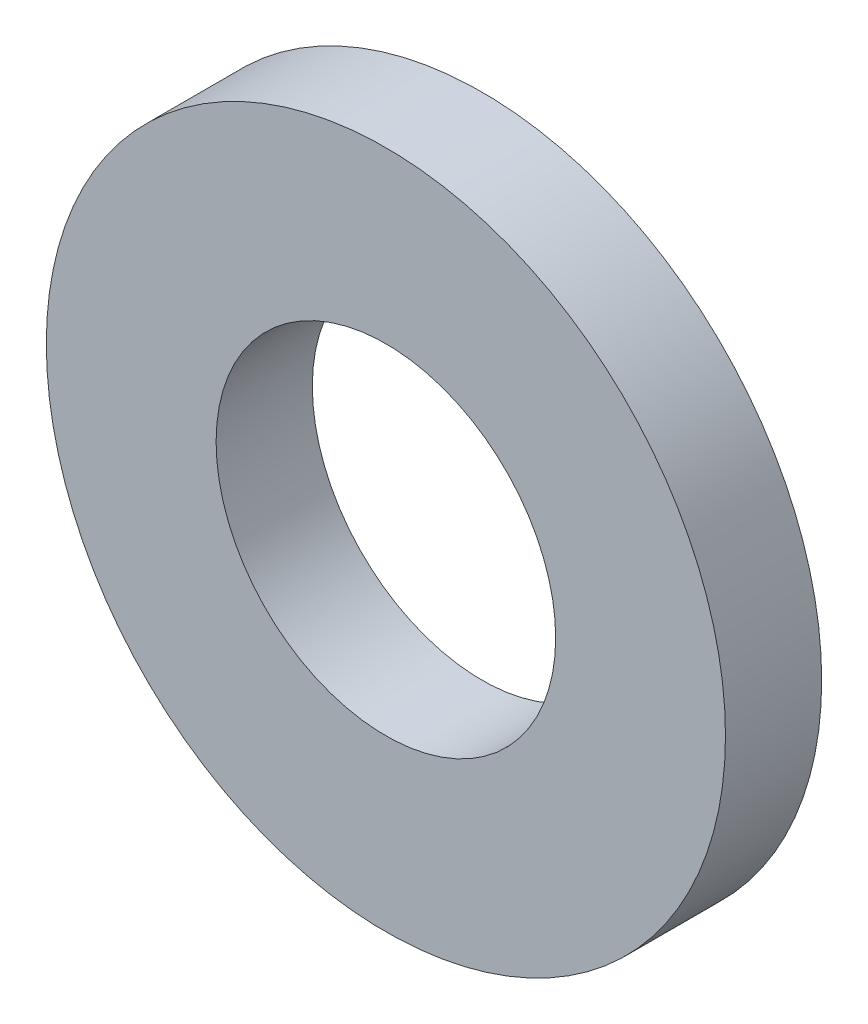
ISO-10303-21;
HEADER;
FILE_DESCRIPTION(('STEP AP214'),'2;1');
FILE_NAME('part.step','',(''),(''),'','','');
FILE_SCHEMA(('AUTOMOTIVE_DESIGN { 1 0 10303 214 1 1 1 1 }'));
ENDSEC;
DATA;
#1=APPLICATION_CONTEXT('core data for automotive mechanical design processes');
#2=APPLICATION_PROTOCOL_DEFINITION('international standard','automotive_design',2000,#1);
#3=PRODUCT_CONTEXT('',#1,'mechanical');
#4=PRODUCT('Part','Part','',(#3));
#5=PRODUCT_RELATED_PRODUCT_CATEGORY('part','',(#4));
#6=PRODUCT_DEFINITION_FORMATION('','',#4);
#7=PRODUCT_DEFINITION_CONTEXT('part definition',#1,'design');
#8=PRODUCT_DEFINITION('design','',#6,#7);
#9=PRODUCT_DEFINITION_SHAPE('','',#8);
#10=(LENGTH_UNIT() NAMED_UNIT(*) SI_UNIT(.MILLI.,.METRE.));
#11=(NAMED_UNIT(*) PLANE_ANGLE_UNIT() SI_UNIT($,.RADIAN.));
#12=(NAMED_UNIT(*) SI_UNIT($,.STERADIAN.) SOLID_ANGLE_UNIT());
#13=UNCERTAINTY_MEASURE_WITH_UNIT(LENGTH_MEASURE(1.E-05),#10,'distance_accuracy_value','');
#14=(GEOMETRIC_REPRESENTATION_CONTEXT(3) GLOBAL_UNCERTAINTY_ASSIGNED_CONTEXT((#13)) GLOBAL_UNIT_ASSIGNED_CONTEXT((#10,
#11,#12)) REPRESENTATION_CONTEXT('',''));
#15=CARTESIAN_POINT('',(0.,0.,0.));
#16=DIRECTION('',(0.,0.,1.));
#17=DIRECTION('',(1.,0.,0.));
#18=AXIS2_PLACEMENT_3D('',#15,#16,#17);
#19=CARTESIAN_POINT('',(0.,0.,1.7));
#20=DIRECTION('',(0.,0.,1.));
#21=DIRECTION('',(1.,0.,0.));
#22=AXIS2_PLACEMENT_3D('',#19,#20,#21);
#23=PLANE('',#22);
#24=CARTESIAN_POINT('',(0.,0.,1.7));
#25=DIRECTION('',(0.,0.,1.));
#26=DIRECTION('',(1.,0.,0.));
#27=AXIS2_PLACEMENT_3D('',#24,#25,#26);
#28=CIRCLE('',#27,6.);
#29=CARTESIAN_POINT('',(6.,0.,1.7));
#30=VERTEX_POINT('',#29);
#31=EDGE_CURVE('E10',#30,#30,#28,.T.);
#32=ORIENTED_EDGE('',*,*,#31,.T.);
#33=EDGE_LOOP('',(#32));
#34=FACE_BOUND('',#33,.T.);
#35=CARTESIAN_POINT('',(0.,0.,1.7));
#36=DIRECTION('',(0.,0.,1.));
#37=DIRECTION('',(1.,0.,0.));
#38=AXIS2_PLACEMENT_3D('',#35,#36,#37);
#39=CIRCLE('',#38,3.);
#40=CARTESIAN_POINT('',(3.,0.,1.7));
#41=VERTEX_POINT('',#40);
#42=EDGE_CURVE('E46',#41,#41,#39,.T.);
#43=ORIENTED_EDGE('',*,*,#42,.F.);
#44=EDGE_LOOP('',(#43));
#45=FACE_BOUND('',#44,.T.);
#46=ADVANCED_FACE('F35',(#34,#45),#23,.T.);
#47=CARTESIAN_POINT('',(0.,0.,0.));
#48=DIRECTION('',(0.,0.,1.));
#49=DIRECTION('',(1.,0.,0.));
#50=AXIS2_PLACEMENT_3D('',#47,#48,#49);
#51=PLANE('',#50);
#52=CARTESIAN_POINT('',(0.,0.,0.));
#53=DIRECTION('',(0.,0.,1.));
#54=DIRECTION('',(1.,0.,0.));
#55=AXIS2_PLACEMENT_3D('',#52,#53,#54);
#56=CIRCLE('',#55,6.);
#57=CARTESIAN_POINT('',(6.,0.,0.));
#58=VERTEX_POINT('',#57);
#59=EDGE_CURVE('E39',#58,#58,#56,.T.);
#60=ORIENTED_EDGE('',*,*,#59,.F.);
#61=EDGE_LOOP('',(#60));
#62=FACE_BOUND('',#61,.T.);
#63=CARTESIAN_POINT('',(0.,0.,0.));
#64=DIRECTION('',(0.,0.,1.));
#65=DIRECTION('',(1.,0.,0.));
#66=AXIS2_PLACEMENT_3D('',#63,#64,#65);
#67=CIRCLE('',#66,3.);
#68=CARTESIAN_POINT('',(3.,0.,0.));
#69=VERTEX_POINT('',#68);
#70=EDGE_CURVE('E48',#69,#69,#67,.T.);
#71=ORIENTED_EDGE('',*,*,#70,.T.);
#72=EDGE_LOOP('',(#71));
#73=FACE_BOUND('',#72,.T.);
#74=ADVANCED_FACE('F58',(#62,#73),#51,.F.);
#75=CARTESIAN_POINT('',(0.,0.,1.7));
#76=DIRECTION('',(0.,0.,-1.));
#77=DIRECTION('',(-1.,0.,0.));
#78=AXIS2_PLACEMENT_3D('',#75,#76,#77);
#79=CYLINDRICAL_SURFACE('',#78,6.);
#80=ORIENTED_EDGE('',*,*,#31,.F.);
#81=EDGE_LOOP('',(#80));
#82=FACE_BOUND('',#81,.T.);
#83=ORIENTED_EDGE('',*,*,#59,.T.);
#84=EDGE_LOOP('',(#83));
#85=FACE_BOUND('',#84,.T.);
#86=ADVANCED_FACE('F37',(#82,#85),#79,.T.);
#87=CARTESIAN_POINT('',(0.,0.,1.7));
#88=DIRECTION('',(0.,0.,-1.));
#89=DIRECTION('',(-1.,0.,0.));
#90=AXIS2_PLACEMENT_3D('',#87,#88,#89);
#91=CYLINDRICAL_SURFACE('',#90,3.);
#92=ORIENTED_EDGE('',*,*,#42,.T.);
#93=EDGE_LOOP('',(#92));
#94=FACE_BOUND('',#93,.T.);
#95=ORIENTED_EDGE('',*,*,#70,.F.);
#96=EDGE_LOOP('',(#95));
#97=FACE_BOUND('',#96,.T.);
#98=ADVANCED_FACE('F54',(#94,#97),#91,.F.);
#99=CLOSED_SHELL('',(#46,#74,#86,#98));
#100=MANIFOLD_SOLID_BREP('B2',#99);
#101=ADVANCED_BREP_SHAPE_REPRESENTATION('',(#18,#100),#14);
#102=SHAPE_DEFINITION_REPRESENTATION(#9,#101);
ENDSEC;
END-ISO-10303-21;
